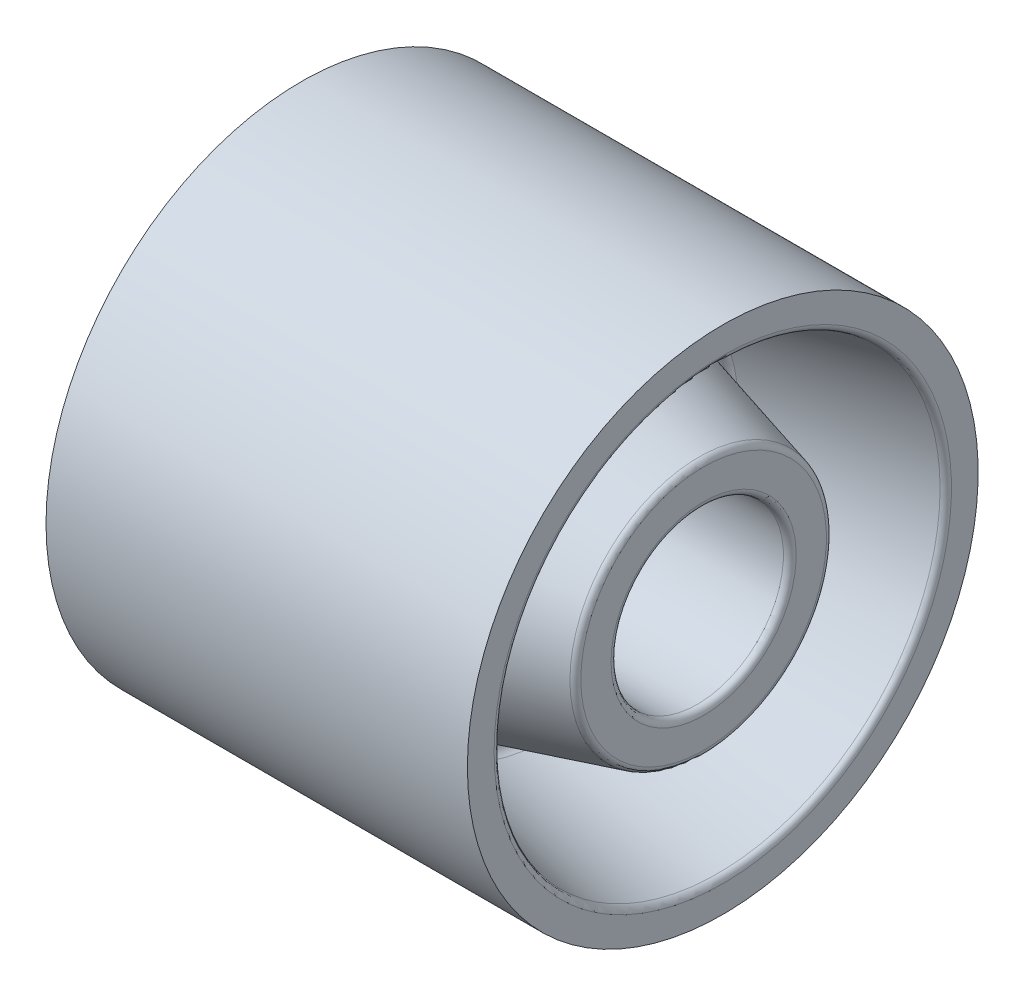
ISO-10303-21;
HEADER;
FILE_DESCRIPTION(('STEP AP214'),'2;1');
FILE_NAME('part.step','',(''),(''),'','','');
FILE_SCHEMA(('AUTOMOTIVE_DESIGN { 1 0 10303 214 1 1 1 1 }'));
ENDSEC;
DATA;
#1=APPLICATION_CONTEXT('core data for automotive mechanical design processes');
#2=APPLICATION_PROTOCOL_DEFINITION('international standard','automotive_design',2000,#1);
#3=PRODUCT_CONTEXT('',#1,'mechanical');
#4=PRODUCT('Part','Part','',(#3));
#5=PRODUCT_RELATED_PRODUCT_CATEGORY('part','',(#4));
#6=PRODUCT_DEFINITION_FORMATION('','',#4);
#7=PRODUCT_DEFINITION_CONTEXT('part definition',#1,'design');
#8=PRODUCT_DEFINITION('design','',#6,#7);
#9=PRODUCT_DEFINITION_SHAPE('','',#8);
#10=(LENGTH_UNIT() NAMED_UNIT(*) SI_UNIT(.MILLI.,.METRE.));
#11=(NAMED_UNIT(*) PLANE_ANGLE_UNIT() SI_UNIT($,.RADIAN.));
#12=(NAMED_UNIT(*) SI_UNIT($,.STERADIAN.) SOLID_ANGLE_UNIT());
#13=UNCERTAINTY_MEASURE_WITH_UNIT(LENGTH_MEASURE(1.E-05),#10,'distance_accuracy_value','');
#14=(GEOMETRIC_REPRESENTATION_CONTEXT(3) GLOBAL_UNCERTAINTY_ASSIGNED_CONTEXT((#13)) GLOBAL_UNIT_ASSIGNED_CONTEXT((#10,
#11,#12)) REPRESENTATION_CONTEXT('',''));
#15=CARTESIAN_POINT('',(0.,0.,0.));
#16=DIRECTION('',(0.,0.,1.));
#17=DIRECTION('',(1.,0.,0.));
#18=AXIS2_PLACEMENT_3D('',#15,#16,#17);
#19=CARTESIAN_POINT('',(-5.61086788878096,0.,0.));
#20=DIRECTION('',(1.,0.,0.));
#21=DIRECTION('',(0.,0.,-1.));
#22=AXIS2_PLACEMENT_3D('',#19,#20,#21);
#23=CONICAL_SURFACE('',#22,26.5513536663429,0.262423051370551);
#24=CARTESIAN_POINT('',(-29.2594214074794,0.,0.));
#25=DIRECTION('',(-1.,0.,0.));
#26=DIRECTION('',(0.,0.,1.));
#27=AXIS2_PLACEMENT_3D('',#24,#25,#26);
#28=CIRCLE('',#27,20.1989325514004);
#29=CARTESIAN_POINT('',(-29.2594214074794,0.,20.1989325514004));
#30=VERTEX_POINT('',#29);
#31=EDGE_CURVE('E59',#30,#30,#28,.F.);
#32=ORIENTED_EDGE('',*,*,#31,.T.);
#33=EDGE_LOOP('',(#32));
#34=FACE_BOUND('',#33,.T.);
#35=CARTESIAN_POINT('',(-5.61086788878096,0.,0.));
#36=DIRECTION('',(-1.,0.,0.));
#37=DIRECTION('',(0.,0.,1.));
#38=AXIS2_PLACEMENT_3D('',#35,#36,#37);
#39=CIRCLE('',#38,26.5513536663429);
#40=CARTESIAN_POINT('',(-5.61086788878096,0.,26.5513536663429));
#41=VERTEX_POINT('',#40);
#42=EDGE_CURVE('E98',#41,#41,#39,.T.);
#43=ORIENTED_EDGE('',*,*,#42,.T.);
#44=EDGE_LOOP('',(#43));
#45=FACE_BOUND('',#44,.T.);
#46=ADVANCED_FACE('F39',(#34,#45),#23,.T.);
#47=CARTESIAN_POINT('',(-30.,13.5,0.));
#48=DIRECTION('',(1.,0.,0.));
#49=DIRECTION('',(0.,0.,-1.));
#50=AXIS2_PLACEMENT_3D('',#47,#48,#49);
#51=PLANE('',#50);
#52=CARTESIAN_POINT('',(-30.,0.,0.));
#53=DIRECTION('',(1.,0.,0.));
#54=DIRECTION('',(0.,0.,-1.));
#55=AXIS2_PLACEMENT_3D('',#52,#53,#54);
#56=CIRCLE('',#55,19.2331683289623);
#57=CARTESIAN_POINT('',(-30.,0.,-19.2331683289623));
#58=VERTEX_POINT('',#57);
#59=EDGE_CURVE('E62',#58,#58,#56,.F.);
#60=ORIENTED_EDGE('',*,*,#59,.T.);
#61=EDGE_LOOP('',(#60));
#62=FACE_BOUND('',#61,.T.);
#63=CARTESIAN_POINT('',(-30.,0.,0.));
#64=DIRECTION('',(1.,0.,0.));
#65=DIRECTION('',(0.,0.,-1.));
#66=AXIS2_PLACEMENT_3D('',#63,#64,#65);
#67=CIRCLE('',#66,14.5);
#68=CARTESIAN_POINT('',(-30.,0.,-14.5));
#69=VERTEX_POINT('',#68);
#70=EDGE_CURVE('E65',#69,#69,#67,.T.);
#71=ORIENTED_EDGE('',*,*,#70,.T.);
#72=EDGE_LOOP('',(#71));
#73=FACE_BOUND('',#72,.T.);
#74=ADVANCED_FACE('F121',(#62,#73),#51,.F.);
#75=CARTESIAN_POINT('',(-33.,0.,0.));
#76=DIRECTION('',(-1.,0.,0.));
#77=DIRECTION('',(0.,0.,1.));
#78=AXIS2_PLACEMENT_3D('',#75,#76,#77);
#79=CYLINDRICAL_SURFACE('',#78,13.5);
#80=CARTESIAN_POINT('',(29.,0.,0.));
#81=DIRECTION('',(-1.,0.,0.));
#82=DIRECTION('',(0.,0.,1.));
#83=AXIS2_PLACEMENT_3D('',#80,#81,#82);
#84=CIRCLE('',#83,13.5);
#85=CARTESIAN_POINT('',(29.,0.,13.5));
#86=VERTEX_POINT('',#85);
#87=EDGE_CURVE('E71',#86,#86,#84,.F.);
#88=ORIENTED_EDGE('',*,*,#87,.T.);
#89=EDGE_LOOP('',(#88));
#90=FACE_BOUND('',#89,.T.);
#91=CARTESIAN_POINT('',(-29.,0.,0.));
#92=DIRECTION('',(1.,0.,0.));
#93=DIRECTION('',(0.,0.,-1.));
#94=AXIS2_PLACEMENT_3D('',#91,#92,#93);
#95=CIRCLE('',#94,13.5);
#96=CARTESIAN_POINT('',(-29.,0.,-13.5));
#97=VERTEX_POINT('',#96);
#98=EDGE_CURVE('E74',#97,#97,#95,.F.);
#99=ORIENTED_EDGE('',*,*,#98,.T.);
#100=EDGE_LOOP('',(#99));
#101=FACE_BOUND('',#100,.T.);
#102=ADVANCED_FACE('F127',(#90,#101),#79,.F.);
#103=CARTESIAN_POINT('',(30.,13.5,0.));
#104=DIRECTION('',(-1.,0.,0.));
#105=DIRECTION('',(0.,0.,1.));
#106=AXIS2_PLACEMENT_3D('',#103,#104,#105);
#107=PLANE('',#106);
#108=CARTESIAN_POINT('',(30.,0.,0.));
#109=DIRECTION('',(-1.,0.,0.));
#110=DIRECTION('',(0.,0.,1.));
#111=AXIS2_PLACEMENT_3D('',#108,#109,#110);
#112=CIRCLE('',#111,14.5);
#113=CARTESIAN_POINT('',(30.,0.,14.5));
#114=VERTEX_POINT('',#113);
#115=EDGE_CURVE('E77',#114,#114,#112,.T.);
#116=ORIENTED_EDGE('',*,*,#115,.T.);
#117=EDGE_LOOP('',(#116));
#118=FACE_BOUND('',#117,.T.);
#119=CARTESIAN_POINT('',(30.,0.,0.));
#120=DIRECTION('',(-1.,0.,0.));
#121=DIRECTION('',(0.,0.,1.));
#122=AXIS2_PLACEMENT_3D('',#119,#120,#121);
#123=CIRCLE('',#122,19.2331683289623);
#124=CARTESIAN_POINT('',(30.,0.,19.2331683289623));
#125=VERTEX_POINT('',#124);
#126=EDGE_CURVE('E80',#125,#125,#123,.F.);
#127=ORIENTED_EDGE('',*,*,#126,.T.);
#128=EDGE_LOOP('',(#127));
#129=FACE_BOUND('',#128,.T.);
#130=ADVANCED_FACE('F180',(#118,#129),#107,.F.);
#131=CARTESIAN_POINT('',(30.,0.,0.));
#132=DIRECTION('',(-1.,0.,0.));
#133=DIRECTION('',(0.,0.,1.));
#134=AXIS2_PLACEMENT_3D('',#131,#132,#133);
#135=CONICAL_SURFACE('',#134,20.,0.262423051370551);
#136=CARTESIAN_POINT('',(29.2594214074793,0.,0.));
#137=DIRECTION('',(1.,0.,0.));
#138=DIRECTION('',(0.,0.,-1.));
#139=AXIS2_PLACEMENT_3D('',#136,#137,#138);
#140=CIRCLE('',#139,20.1989325514004);
#141=CARTESIAN_POINT('',(29.2594214074793,0.,-20.1989325514004));
#142=VERTEX_POINT('',#141);
#143=EDGE_CURVE('E68',#142,#142,#140,.F.);
#144=ORIENTED_EDGE('',*,*,#143,.T.);
#145=EDGE_LOOP('',(#144));
#146=FACE_BOUND('',#145,.T.);
#147=CARTESIAN_POINT('',(5.61086788878096,0.,0.));
#148=DIRECTION('',(-1.,0.,0.));
#149=DIRECTION('',(0.,0.,1.));
#150=AXIS2_PLACEMENT_3D('',#147,#148,#149);
#151=CIRCLE('',#150,26.5513536663429);
#152=CARTESIAN_POINT('',(5.61086788878096,0.,26.5513536663429));
#153=VERTEX_POINT('',#152);
#154=EDGE_CURVE('E83',#153,#153,#151,.T.);
#155=ORIENTED_EDGE('',*,*,#154,.F.);
#156=EDGE_LOOP('',(#155));
#157=FACE_BOUND('',#156,.T.);
#158=ADVANCED_FACE('F176',(#146,#157),#135,.T.);
#159=CARTESIAN_POINT('',(6.,0.,0.));
#160=DIRECTION('',(-1.,0.,0.));
#161=DIRECTION('',(0.,0.,1.));
#162=AXIS2_PLACEMENT_3D('',#159,#160,#161);
#163=TOROIDAL_SURFACE('',#162,28.,1.5);
#164=CARTESIAN_POINT('',(6.00000000000001,0.,0.));
#165=DIRECTION('',(-1.,0.,0.));
#166=DIRECTION('',(0.,0.,1.));
#167=AXIS2_PLACEMENT_3D('',#164,#165,#166);
#168=CIRCLE('',#167,29.5);
#169=CARTESIAN_POINT('',(6.00000000000001,0.,29.5));
#170=VERTEX_POINT('',#169);
#171=EDGE_CURVE('E86',#170,#170,#168,.T.);
#172=ORIENTED_EDGE('',*,*,#171,.F.);
#173=EDGE_LOOP('',(#172));
#174=FACE_BOUND('',#173,.T.);
#175=ORIENTED_EDGE('',*,*,#154,.T.);
#176=EDGE_LOOP('',(#175));
#177=FACE_BOUND('',#176,.T.);
#178=ADVANCED_FACE('F173',(#174,#177),#163,.F.);
#179=CARTESIAN_POINT('',(6.00000000000001,0.,0.));
#180=DIRECTION('',(1.,0.,0.));
#181=DIRECTION('',(0.,0.,-1.));
#182=AXIS2_PLACEMENT_3D('',#179,#180,#181);
#183=CONICAL_SURFACE('',#182,29.5,0.200954263688097);
#184=CARTESIAN_POINT('',(32.1996044821443,0.,0.));
#185=DIRECTION('',(-1.,0.,0.));
#186=DIRECTION('',(0.,0.,1.));
#187=AXIS2_PLACEMENT_3D('',#184,#185,#186);
#188=CIRCLE('',#187,34.8369564685849);
#189=CARTESIAN_POINT('',(32.1996044821443,0.,34.8369564685849));
#190=VERTEX_POINT('',#189);
#191=EDGE_CURVE('E50',#190,#190,#188,.F.);
#192=ORIENTED_EDGE('',*,*,#191,.T.);
#193=EDGE_LOOP('',(#192));
#194=FACE_BOUND('',#193,.T.);
#195=ORIENTED_EDGE('',*,*,#171,.T.);
#196=EDGE_LOOP('',(#195));
#197=FACE_BOUND('',#196,.T.);
#198=ADVANCED_FACE('F159',(#194,#197),#183,.F.);
#199=CARTESIAN_POINT('',(33.,35.,0.));
#200=DIRECTION('',(-1.,0.,0.));
#201=DIRECTION('',(0.,0.,1.));
#202=AXIS2_PLACEMENT_3D('',#199,#200,#201);
#203=PLANE('',#202);
#204=CARTESIAN_POINT('',(33.,0.,0.));
#205=DIRECTION('',(-1.,0.,0.));
#206=DIRECTION('',(0.,0.,1.));
#207=AXIS2_PLACEMENT_3D('',#204,#205,#206);
#208=CIRCLE('',#207,35.816833017293);
#209=CARTESIAN_POINT('',(33.,0.,35.816833017293));
#210=VERTEX_POINT('',#209);
#211=EDGE_CURVE('E54',#210,#210,#208,.T.);
#212=ORIENTED_EDGE('',*,*,#211,.T.);
#213=EDGE_LOOP('',(#212));
#214=FACE_BOUND('',#213,.T.);
#215=CARTESIAN_POINT('',(33.,0.,0.));
#216=DIRECTION('',(-1.,0.,0.));
#217=DIRECTION('',(0.,0.,1.));
#218=AXIS2_PLACEMENT_3D('',#215,#216,#217);
#219=CIRCLE('',#218,40.);
#220=CARTESIAN_POINT('',(33.,0.,40.));
#221=VERTEX_POINT('',#220);
#222=EDGE_CURVE('E89',#221,#221,#219,.T.);
#223=ORIENTED_EDGE('',*,*,#222,.F.);
#224=EDGE_LOOP('',(#223));
#225=FACE_BOUND('',#224,.T.);
#226=ADVANCED_FACE('F156',(#214,#225),#203,.F.);
#227=CARTESIAN_POINT('',(-33.,0.,0.));
#228=DIRECTION('',(-1.,0.,0.));
#229=DIRECTION('',(0.,0.,1.));
#230=AXIS2_PLACEMENT_3D('',#227,#228,#229);
#231=CYLINDRICAL_SURFACE('',#230,40.);
#232=CARTESIAN_POINT('',(-33.,0.,0.));
#233=DIRECTION('',(-1.,0.,0.));
#234=DIRECTION('',(0.,0.,1.));
#235=AXIS2_PLACEMENT_3D('',#232,#233,#234);
#236=CIRCLE('',#235,40.);
#237=CARTESIAN_POINT('',(-33.,0.,40.));
#238=VERTEX_POINT('',#237);
#239=EDGE_CURVE('E92',#238,#238,#236,.T.);
#240=ORIENTED_EDGE('',*,*,#239,.F.);
#241=EDGE_LOOP('',(#240));
#242=FACE_BOUND('',#241,.T.);
#243=ORIENTED_EDGE('',*,*,#222,.T.);
#244=EDGE_LOOP('',(#243));
#245=FACE_BOUND('',#244,.T.);
#246=ADVANCED_FACE('F118',(#242,#245),#231,.T.);
#247=CARTESIAN_POINT('',(-33.,35.,0.));
#248=DIRECTION('',(1.,0.,0.));
#249=DIRECTION('',(0.,0.,-1.));
#250=AXIS2_PLACEMENT_3D('',#247,#248,#249);
#251=PLANE('',#250);
#252=CARTESIAN_POINT('',(-33.,0.,0.));
#253=DIRECTION('',(1.,0.,0.));
#254=DIRECTION('',(0.,0.,-1.));
#255=AXIS2_PLACEMENT_3D('',#252,#253,#254);
#256=CIRCLE('',#255,35.816833017293);
#257=CARTESIAN_POINT('',(-33.,0.,-35.816833017293));
#258=VERTEX_POINT('',#257);
#259=EDGE_CURVE('E10',#258,#258,#256,.T.);
#260=ORIENTED_EDGE('',*,*,#259,.T.);
#261=EDGE_LOOP('',(#260));
#262=FACE_BOUND('',#261,.T.);
#263=ORIENTED_EDGE('',*,*,#239,.T.);
#264=EDGE_LOOP('',(#263));
#265=FACE_BOUND('',#264,.T.);
#266=ADVANCED_FACE('F112',(#262,#265),#251,.F.);
#267=CARTESIAN_POINT('',(-33.,0.,0.));
#268=DIRECTION('',(-1.,0.,0.));
#269=DIRECTION('',(0.,0.,1.));
#270=AXIS2_PLACEMENT_3D('',#267,#268,#269);
#271=CONICAL_SURFACE('',#270,35.,0.200954263688097);
#272=CARTESIAN_POINT('',(-32.1996044821442,0.,0.));
#273=DIRECTION('',(1.,0.,0.));
#274=DIRECTION('',(0.,0.,-1.));
#275=AXIS2_PLACEMENT_3D('',#272,#273,#274);
#276=CIRCLE('',#275,34.8369564685849);
#277=CARTESIAN_POINT('',(-32.1996044821442,0.,-34.8369564685849));
#278=VERTEX_POINT('',#277);
#279=EDGE_CURVE('E46',#278,#278,#276,.F.);
#280=ORIENTED_EDGE('',*,*,#279,.T.);
#281=EDGE_LOOP('',(#280));
#282=FACE_BOUND('',#281,.T.);
#283=CARTESIAN_POINT('',(-6.,0.,0.));
#284=DIRECTION('',(-1.,0.,0.));
#285=DIRECTION('',(0.,0.,1.));
#286=AXIS2_PLACEMENT_3D('',#283,#284,#285);
#287=CIRCLE('',#286,29.5);
#288=CARTESIAN_POINT('',(-6.,0.,29.5));
#289=VERTEX_POINT('',#288);
#290=EDGE_CURVE('E95',#289,#289,#287,.T.);
#291=ORIENTED_EDGE('',*,*,#290,.F.);
#292=EDGE_LOOP('',(#291));
#293=FACE_BOUND('',#292,.T.);
#294=ADVANCED_FACE('F107',(#282,#293),#271,.F.);
#295=CARTESIAN_POINT('',(-6.,0.,0.));
#296=DIRECTION('',(-1.,0.,0.));
#297=DIRECTION('',(0.,0.,1.));
#298=AXIS2_PLACEMENT_3D('',#295,#296,#297);
#299=TOROIDAL_SURFACE('',#298,28.,1.5);
#300=ORIENTED_EDGE('',*,*,#42,.F.);
#301=EDGE_LOOP('',(#300));
#302=FACE_BOUND('',#301,.T.);
#303=ORIENTED_EDGE('',*,*,#290,.T.);
#304=EDGE_LOOP('',(#303));
#305=FACE_BOUND('',#304,.T.);
#306=ADVANCED_FACE('F103',(#302,#305),#299,.F.);
#307=CARTESIAN_POINT('',(29.,0.,0.));
#308=DIRECTION('',(-1.,0.,0.));
#309=DIRECTION('',(0.,0.,1.));
#310=AXIS2_PLACEMENT_3D('',#307,#308,#309);
#311=TOROIDAL_SURFACE('',#310,14.5,1.);
#312=ORIENTED_EDGE('',*,*,#87,.F.);
#313=EDGE_LOOP('',(#312));
#314=FACE_BOUND('',#313,.T.);
#315=ORIENTED_EDGE('',*,*,#115,.F.);
#316=EDGE_LOOP('',(#315));
#317=FACE_BOUND('',#316,.T.);
#318=ADVANCED_FACE('F106',(#314,#317),#311,.T.);
#319=CARTESIAN_POINT('',(29.,0.,0.));
#320=DIRECTION('',(-1.,0.,0.));
#321=DIRECTION('',(0.,0.,1.));
#322=AXIS2_PLACEMENT_3D('',#319,#320,#321);
#323=TOROIDAL_SURFACE('',#322,19.2331683289623,1.);
#324=ORIENTED_EDGE('',*,*,#126,.F.);
#325=EDGE_LOOP('',(#324));
#326=FACE_BOUND('',#325,.T.);
#327=ORIENTED_EDGE('',*,*,#143,.F.);
#328=EDGE_LOOP('',(#327));
#329=FACE_BOUND('',#328,.T.);
#330=ADVANCED_FACE('F133',(#326,#329),#323,.T.);
#331=CARTESIAN_POINT('',(-29.,0.,0.));
#332=DIRECTION('',(1.,0.,0.));
#333=DIRECTION('',(0.,0.,-1.));
#334=AXIS2_PLACEMENT_3D('',#331,#332,#333);
#335=TOROIDAL_SURFACE('',#334,19.2331683289623,1.);
#336=ORIENTED_EDGE('',*,*,#31,.F.);
#337=EDGE_LOOP('',(#336));
#338=FACE_BOUND('',#337,.T.);
#339=ORIENTED_EDGE('',*,*,#59,.F.);
#340=EDGE_LOOP('',(#339));
#341=FACE_BOUND('',#340,.T.);
#342=ADVANCED_FACE('F137',(#338,#341),#335,.T.);
#343=CARTESIAN_POINT('',(-29.,0.,0.));
#344=DIRECTION('',(1.,0.,0.));
#345=DIRECTION('',(0.,0.,-1.));
#346=AXIS2_PLACEMENT_3D('',#343,#344,#345);
#347=TOROIDAL_SURFACE('',#346,14.5,1.);
#348=ORIENTED_EDGE('',*,*,#70,.F.);
#349=EDGE_LOOP('',(#348));
#350=FACE_BOUND('',#349,.T.);
#351=ORIENTED_EDGE('',*,*,#98,.F.);
#352=EDGE_LOOP('',(#351));
#353=FACE_BOUND('',#352,.T.);
#354=ADVANCED_FACE('F141',(#350,#353),#347,.T.);
#355=CARTESIAN_POINT('',(32.,0.,0.));
#356=DIRECTION('',(-1.,0.,0.));
#357=DIRECTION('',(0.,0.,1.));
#358=AXIS2_PLACEMENT_3D('',#355,#356,#357);
#359=TOROIDAL_SURFACE('',#358,35.816833017293,1.);
#360=ORIENTED_EDGE('',*,*,#191,.F.);
#361=EDGE_LOOP('',(#360));
#362=FACE_BOUND('',#361,.T.);
#363=ORIENTED_EDGE('',*,*,#211,.F.);
#364=EDGE_LOOP('',(#363));
#365=FACE_BOUND('',#364,.T.);
#366=ADVANCED_FACE('F144',(#362,#365),#359,.T.);
#367=CARTESIAN_POINT('',(-32.,0.,0.));
#368=DIRECTION('',(1.,0.,0.));
#369=DIRECTION('',(0.,0.,-1.));
#370=AXIS2_PLACEMENT_3D('',#367,#368,#369);
#371=TOROIDAL_SURFACE('',#370,35.816833017293,1.);
#372=ORIENTED_EDGE('',*,*,#259,.F.);
#373=EDGE_LOOP('',(#372));
#374=FACE_BOUND('',#373,.T.);
#375=ORIENTED_EDGE('',*,*,#279,.F.);
#376=EDGE_LOOP('',(#375));
#377=FACE_BOUND('',#376,.T.);
#378=ADVANCED_FACE('F41',(#374,#377),#371,.T.);
#379=CLOSED_SHELL('',(#46,#74,#102,#130,#158,#178,#198,#226,#246,#266,#294,#306,#318,#330,#342,
#354,#366,#378));
#380=MANIFOLD_SOLID_BREP('B2',#379);
#381=ADVANCED_BREP_SHAPE_REPRESENTATION('',(#18,#380),#14);
#382=SHAPE_DEFINITION_REPRESENTATION(#9,#381);
ENDSEC;
END-ISO-10303-21;
